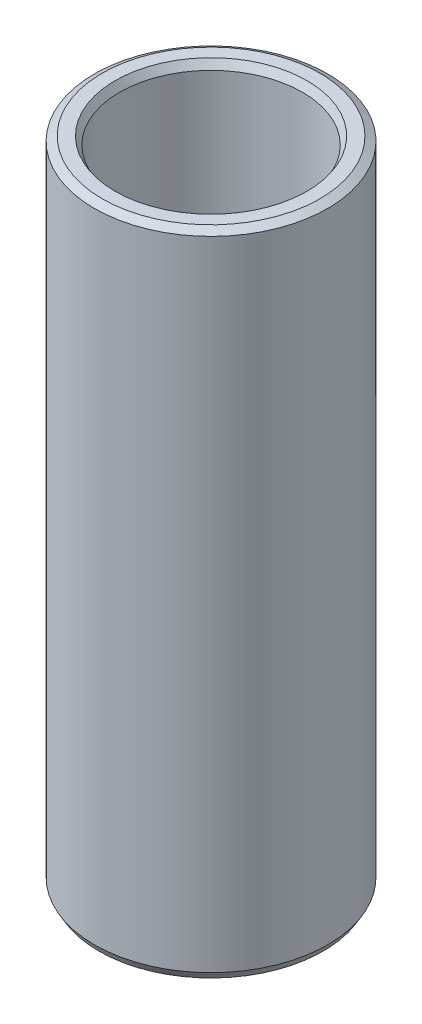
ISO-10303-21;
HEADER;
FILE_DESCRIPTION(('STEP AP214'),'2;1');
FILE_NAME('part.step','',(''),(''),'','','');
FILE_SCHEMA(('AUTOMOTIVE_DESIGN { 1 0 10303 214 1 1 1 1 }'));
ENDSEC;
DATA;
#1=APPLICATION_CONTEXT('core data for automotive mechanical design processes');
#2=APPLICATION_PROTOCOL_DEFINITION('international standard','automotive_design',2000,#1);
#3=PRODUCT_CONTEXT('',#1,'mechanical');
#4=PRODUCT('Part','Part','',(#3));
#5=PRODUCT_RELATED_PRODUCT_CATEGORY('part','',(#4));
#6=PRODUCT_DEFINITION_FORMATION('','',#4);
#7=PRODUCT_DEFINITION_CONTEXT('part definition',#1,'design');
#8=PRODUCT_DEFINITION('design','',#6,#7);
#9=PRODUCT_DEFINITION_SHAPE('','',#8);
#10=(LENGTH_UNIT() NAMED_UNIT(*) SI_UNIT(.MILLI.,.METRE.));
#11=(NAMED_UNIT(*) PLANE_ANGLE_UNIT() SI_UNIT($,.RADIAN.));
#12=(NAMED_UNIT(*) SI_UNIT($,.STERADIAN.) SOLID_ANGLE_UNIT());
#13=UNCERTAINTY_MEASURE_WITH_UNIT(LENGTH_MEASURE(1.E-05),#10,'distance_accuracy_value','');
#14=(GEOMETRIC_REPRESENTATION_CONTEXT(3) GLOBAL_UNCERTAINTY_ASSIGNED_CONTEXT((#13)) GLOBAL_UNIT_ASSIGNED_CONTEXT((#10,
#11,#12)) REPRESENTATION_CONTEXT('',''));
#15=CARTESIAN_POINT('',(0.,0.,0.));
#16=DIRECTION('',(0.,0.,1.));
#17=DIRECTION('',(1.,0.,0.));
#18=AXIS2_PLACEMENT_3D('',#15,#16,#17);
#19=CARTESIAN_POINT('',(0.,292.552172585517,0.));
#20=DIRECTION('',(0.,-1.,0.));
#21=DIRECTION('',(0.,0.,-1.));
#22=AXIS2_PLACEMENT_3D('',#19,#20,#21);
#23=CYLINDRICAL_SURFACE('',#22,52.5);
#24=CARTESIAN_POINT('',(0.,3.50682642514993,0.));
#25=DIRECTION('',(0.,1.,0.));
#26=DIRECTION('',(0.,0.,1.));
#27=AXIS2_PLACEMENT_3D('',#24,#25,#26);
#28=CIRCLE('',#27,52.5);
#29=CARTESIAN_POINT('',(0.,3.50682642514993,52.5));
#30=VERTEX_POINT('',#29);
#31=EDGE_CURVE('E10',#30,#30,#28,.T.);
#32=ORIENTED_EDGE('',*,*,#31,.T.);
#33=EDGE_LOOP('',(#32));
#34=FACE_BOUND('',#33,.T.);
#35=CARTESIAN_POINT('',(0.,290.527505404955,0.));
#36=DIRECTION('',(0.,1.,0.));
#37=DIRECTION('',(0.,0.,1.));
#38=AXIS2_PLACEMENT_3D('',#35,#36,#37);
#39=CIRCLE('',#38,52.5);
#40=CARTESIAN_POINT('',(0.,290.527505404955,52.5));
#41=VERTEX_POINT('',#40);
#42=EDGE_CURVE('E50',#41,#41,#39,.F.);
#43=ORIENTED_EDGE('',*,*,#42,.T.);
#44=EDGE_LOOP('',(#43));
#45=FACE_BOUND('',#44,.T.);
#46=ADVANCED_FACE('F39',(#34,#45),#23,.T.);
#47=CARTESIAN_POINT('',(0.,292.552172585517,0.));
#48=DIRECTION('',(0.,1.,0.));
#49=DIRECTION('',(0.,0.,1.));
#50=AXIS2_PLACEMENT_3D('',#47,#48,#49);
#51=PLANE('',#50);
#52=CARTESIAN_POINT('',(0.,292.552172585517,0.));
#53=DIRECTION('',(0.,1.,0.));
#54=DIRECTION('',(0.,0.,1.));
#55=AXIS2_PLACEMENT_3D('',#52,#53,#54);
#56=CIRCLE('',#55,43.1630909627018);
#57=CARTESIAN_POINT('',(0.,292.552172585517,43.1630909627018));
#58=VERTEX_POINT('',#57);
#59=EDGE_CURVE('E58',#58,#58,#56,.F.);
#60=ORIENTED_EDGE('',*,*,#59,.T.);
#61=EDGE_LOOP('',(#60));
#62=FACE_BOUND('',#61,.T.);
#63=CARTESIAN_POINT('',(0.,292.552172585517,0.));
#64=DIRECTION('',(0.,1.,0.));
#65=DIRECTION('',(0.,0.,1.));
#66=AXIS2_PLACEMENT_3D('',#63,#64,#65);
#67=CIRCLE('',#66,48.9931735748501);
#68=CARTESIAN_POINT('',(0.,292.552172585517,48.9931735748501));
#69=VERTEX_POINT('',#68);
#70=EDGE_CURVE('E61',#69,#69,#67,.T.);
#71=ORIENTED_EDGE('',*,*,#70,.T.);
#72=EDGE_LOOP('',(#71));
#73=FACE_BOUND('',#72,.T.);
#74=ADVANCED_FACE('F88',(#62,#73),#51,.T.);
#75=CARTESIAN_POINT('',(0.,0.,0.));
#76=DIRECTION('',(0.,1.,0.));
#77=DIRECTION('',(0.,0.,1.));
#78=AXIS2_PLACEMENT_3D('',#75,#76,#77);
#79=PLANE('',#78);
#80=CARTESIAN_POINT('',(0.,0.,0.));
#81=DIRECTION('',(0.,1.,0.));
#82=DIRECTION('',(0.,0.,1.));
#83=AXIS2_PLACEMENT_3D('',#80,#81,#82);
#84=CIRCLE('',#83,44.6452502072902);
#85=CARTESIAN_POINT('',(0.,0.,44.6452502072902));
#86=VERTEX_POINT('',#85);
#87=EDGE_CURVE('E51',#86,#86,#84,.T.);
#88=ORIENTED_EDGE('',*,*,#87,.T.);
#89=EDGE_LOOP('',(#88));
#90=FACE_BOUND('',#89,.T.);
#91=CARTESIAN_POINT('',(0.,0.,0.));
#92=DIRECTION('',(0.,1.,0.));
#93=DIRECTION('',(0.,0.,1.));
#94=AXIS2_PLACEMENT_3D('',#91,#92,#93);
#95=CIRCLE('',#94,50.4753328194384);
#96=CARTESIAN_POINT('',(0.,0.,50.4753328194384));
#97=VERTEX_POINT('',#96);
#98=EDGE_CURVE('E54',#97,#97,#95,.F.);
#99=ORIENTED_EDGE('',*,*,#98,.T.);
#100=EDGE_LOOP('',(#99));
#101=FACE_BOUND('',#100,.T.);
#102=ADVANCED_FACE('F83',(#90,#101),#79,.F.);
#103=CARTESIAN_POINT('',(0.,292.552172585517,0.));
#104=DIRECTION('',(0.,-1.,0.));
#105=DIRECTION('',(0.,0.,-1.));
#106=AXIS2_PLACEMENT_3D('',#103,#104,#105);
#107=CYLINDRICAL_SURFACE('',#106,41.1384237821402);
#108=CARTESIAN_POINT('',(0.,289.045346160367,0.));
#109=DIRECTION('',(0.,1.,0.));
#110=DIRECTION('',(0.,0.,1.));
#111=AXIS2_PLACEMENT_3D('',#108,#109,#110);
#112=CIRCLE('',#111,41.1384237821402);
#113=CARTESIAN_POINT('',(0.,289.045346160367,41.1384237821402));
#114=VERTEX_POINT('',#113);
#115=EDGE_CURVE('E67',#114,#114,#112,.T.);
#116=ORIENTED_EDGE('',*,*,#115,.T.);
#117=EDGE_LOOP('',(#116));
#118=FACE_BOUND('',#117,.T.);
#119=CARTESIAN_POINT('',(0.,2.02466718056171,0.));
#120=DIRECTION('',(0.,1.,0.));
#121=DIRECTION('',(0.,0.,1.));
#122=AXIS2_PLACEMENT_3D('',#119,#120,#121);
#123=CIRCLE('',#122,41.1384237821402);
#124=CARTESIAN_POINT('',(0.,2.02466718056171,41.1384237821402));
#125=VERTEX_POINT('',#124);
#126=EDGE_CURVE('E69',#125,#125,#123,.F.);
#127=ORIENTED_EDGE('',*,*,#126,.T.);
#128=EDGE_LOOP('',(#127));
#129=FACE_BOUND('',#128,.T.);
#130=ADVANCED_FACE('F71',(#118,#129),#107,.F.);
#131=CARTESIAN_POINT('',(0.,289.045346160367,0.));
#132=DIRECTION('',(0.,1.,0.));
#133=DIRECTION('',(0.,0.,1.));
#134=AXIS2_PLACEMENT_3D('',#131,#132,#133);
#135=CONICAL_SURFACE('',#134,41.1384237821402,0.523598775598303);
#136=CARTESIAN_POINT('',(0.,292.552172585517,43.1630909627018));
#137=CARTESIAN_POINT('',(0.,292.515643143588,43.142000679571));
#138=CARTESIAN_POINT('',(0.,292.479113701659,43.1209103964401));
#139=CARTESIAN_POINT('',(0.,292.406054817802,43.0787298301784));
#140=CARTESIAN_POINT('',(0.,292.369525375873,43.0576395470476));
#141=CARTESIAN_POINT('',(0.,292.296466492016,43.0154589807859));
#142=CARTESIAN_POINT('',(0.,292.259937050087,42.994368697655));
#143=CARTESIAN_POINT('',(0.,292.18687816623,42.9521881313933));
#144=CARTESIAN_POINT('',(0.,292.150348724301,42.9310978482625));
#145=CARTESIAN_POINT('',(0.,292.077289840444,42.8889172820007));
#146=CARTESIAN_POINT('',(0.,292.040760398515,42.8678269988699));
#147=CARTESIAN_POINT('',(0.,291.967701514658,42.8256464326082));
#148=CARTESIAN_POINT('',(0.,291.93117207273,42.8045561494773));
#149=CARTESIAN_POINT('',(0.,291.858113188872,42.7623755832156));
#150=CARTESIAN_POINT('',(0.,291.821583746944,42.7412853000848));
#151=CARTESIAN_POINT('',(0.,291.748524863086,42.6991047338231));
#152=CARTESIAN_POINT('',(0.,291.711995421158,42.6780144506922));
#153=CARTESIAN_POINT('',(0.,291.6389365373,42.6358338844305));
#154=CARTESIAN_POINT('',(0.,291.602407095372,42.6147436012997));
#155=CARTESIAN_POINT('',(0.,291.529348211514,42.572563035038));
#156=CARTESIAN_POINT('',(0.,291.492818769586,42.5514727519071));
#157=CARTESIAN_POINT('',(0.,291.419759885728,42.5092921856454));
#158=CARTESIAN_POINT('',(0.,291.3832304438,42.4882019025146));
#159=CARTESIAN_POINT('',(0.,291.310171559943,42.4460213362529));
#160=CARTESIAN_POINT('',(0.,291.273642118014,42.424931053122));
#161=CARTESIAN_POINT('',(0.,291.200583234157,42.3827504868603));
#162=CARTESIAN_POINT('',(0.,291.164053792228,42.3616602037295));
#163=CARTESIAN_POINT('',(0.,291.090994908371,42.3194796374678));
#164=CARTESIAN_POINT('',(0.,291.054465466442,42.2983893543369));
#165=CARTESIAN_POINT('',(0.,290.981406582585,42.2562087880752));
#166=CARTESIAN_POINT('',(0.,290.944877140656,42.2351185049444));
#167=CARTESIAN_POINT('',(0.,290.871818256799,42.1929379386827));
#168=CARTESIAN_POINT('',(0.,290.83528881487,42.1718476555518));
#169=CARTESIAN_POINT('',(0.,290.762229931013,42.1296670892901));
#170=CARTESIAN_POINT('',(0.,290.725700489084,42.1085768061593));
#171=CARTESIAN_POINT('',(0.,290.652641605227,42.0663962398976));
#172=CARTESIAN_POINT('',(0.,290.616112163298,42.0453059567667));
#173=CARTESIAN_POINT('',(0.,290.543053279441,42.003125390505));
#174=CARTESIAN_POINT('',(0.,290.506523837512,41.9820351073742));
#175=CARTESIAN_POINT('',(0.,290.433464953655,41.9398545411125));
#176=CARTESIAN_POINT('',(0.,290.396935511726,41.9187642579816));
#177=CARTESIAN_POINT('',(0.,290.323876627869,41.8765836917199));
#178=CARTESIAN_POINT('',(0.,290.28734718594,41.8554934085891));
#179=CARTESIAN_POINT('',(0.,290.214288302083,41.8133128423274));
#180=CARTESIAN_POINT('',(0.,290.177758860154,41.7922225591965));
#181=CARTESIAN_POINT('',(0.,290.104699976297,41.7500419929348));
#182=CARTESIAN_POINT('',(0.,290.068170534369,41.728951709804));
#183=CARTESIAN_POINT('',(0.,289.995111650511,41.6867711435423));
#184=CARTESIAN_POINT('',(0.,289.958582208583,41.6656808604114));
#185=CARTESIAN_POINT('',(0.,289.885523324725,41.6235002941497));
#186=CARTESIAN_POINT('',(0.,289.848993882797,41.6024100110189));
#187=CARTESIAN_POINT('',(0.,289.775934998939,41.5602294447572));
#188=CARTESIAN_POINT('',(0.,289.739405557011,41.5391391616263));
#189=CARTESIAN_POINT('',(0.,289.666346673153,41.4969585953646));
#190=CARTESIAN_POINT('',(0.,289.629817231225,41.4758683122338));
#191=CARTESIAN_POINT('',(0.,289.556758347368,41.4336877459721));
#192=CARTESIAN_POINT('',(0.,289.520228905439,41.4125974628412));
#193=CARTESIAN_POINT('',(0.,289.447170021582,41.3704168965795));
#194=CARTESIAN_POINT('',(0.,289.410640579653,41.3493266134487));
#195=CARTESIAN_POINT('',(0.,289.337581695796,41.307146047187));
#196=CARTESIAN_POINT('',(0.,289.301052253867,41.2860557640561));
#197=CARTESIAN_POINT('',(0.,289.22799337001,41.2438751977944));
#198=CARTESIAN_POINT('',(0.,289.191463928081,41.2227849146635));
#199=CARTESIAN_POINT('',(0.,289.118405044224,41.1806043484019));
#200=CARTESIAN_POINT('',(0.,289.081875602295,41.159514065271));
#201=CARTESIAN_POINT('',(0.,289.045346160367,41.1384237821402));
#202=B_SPLINE_CURVE_WITH_KNOTS('',3,(#136,#137,#138,#139,#140,#141,#142,#143,#144,#145,#146,
#147,#148,#149,#150,#151,#152,#153,#154,#155,#156,#157,#158,#159,#160,#161,#162,#163,#164,#165,
#166,#167,#168,#169,#170,#171,#172,#173,#174,#175,#176,#177,#178,#179,#180,#181,#182,#183,#184,
#185,#186,#187,#188,#189,#190,#191,#192,#193,#194,#195,#196,#197,#198,#199,#200,#201),
.UNSPECIFIED.,.F.,.F.,(4,2,2,2,2,2,2,2,2,2,2,2,2,2,2,2,2,2,2,2,2,2,2,2,2,2,2,2,2,2,2,2,4),(0.,
0.126541698785113,0.253083397570225,0.379625096355334,0.506166795140447,0.63270849392556,
0.759250192710624,0.885791891495737,1.01233359028085,1.13887528906596,1.26541698785107,
1.39195868663613,1.51850038542124,1.64504208420636,1.77158378299147,1.89812548177658,
2.02466718056164,2.15120887934676,2.27775057813187,2.40429227691698,2.53083397570209,
2.6573756744872,2.78391737327227,2.91045907205738,3.03700077084249,3.1635424696276,
3.29008416841272,3.41662586719778,3.54316756598289,3.669709264768,3.79625096355311,
3.92279266233823,4.04933436112329),.UNSPECIFIED.);
#203=EDGE_CURVE('BSEAM77',#58,#114,#202,.T.);
#204=ORIENTED_EDGE('',*,*,#59,.F.);
#205=ORIENTED_EDGE('',*,*,#115,.F.);
#206=ORIENTED_EDGE('',*,*,#203,.T.);
#207=ORIENTED_EDGE('',*,*,#203,.F.);
#208=EDGE_LOOP('',(#204,#206,#205,#207));
#209=FACE_BOUND('',#208,.T.);
#210=ADVANCED_FACE('F77',(#209),#135,.F.);
#211=CARTESIAN_POINT('',(0.,0.,0.));
#212=DIRECTION('',(0.,-1.,0.));
#213=DIRECTION('',(0.,0.,-1.));
#214=AXIS2_PLACEMENT_3D('',#211,#212,#213);
#215=CONICAL_SURFACE('',#214,44.6452502072902,1.04719755119659);
#216=ORIENTED_EDGE('',*,*,#126,.F.);
#217=EDGE_LOOP('',(#216));
#218=FACE_BOUND('',#217,.T.);
#219=ORIENTED_EDGE('',*,*,#87,.F.);
#220=EDGE_LOOP('',(#219));
#221=FACE_BOUND('',#220,.T.);
#222=ADVANCED_FACE('F73',(#218,#221),#215,.F.);
#223=CARTESIAN_POINT('',(0.,3.50682642514993,0.));
#224=DIRECTION('',(0.,1.,0.));
#225=DIRECTION('',(0.,0.,1.));
#226=AXIS2_PLACEMENT_3D('',#223,#224,#225);
#227=CONICAL_SURFACE('',#226,52.5,0.523598775598302);
#228=ORIENTED_EDGE('',*,*,#98,.F.);
#229=EDGE_LOOP('',(#228));
#230=FACE_BOUND('',#229,.T.);
#231=ORIENTED_EDGE('',*,*,#31,.F.);
#232=EDGE_LOOP('',(#231));
#233=FACE_BOUND('',#232,.T.);
#234=ADVANCED_FACE('F76',(#230,#233),#227,.T.);
#235=CARTESIAN_POINT('',(0.,292.552172585517,0.));
#236=DIRECTION('',(0.,-1.,0.));
#237=DIRECTION('',(0.,0.,-1.));
#238=AXIS2_PLACEMENT_3D('',#235,#236,#237);
#239=CONICAL_SURFACE('',#238,48.9931735748501,1.04719755119659);
#240=ORIENTED_EDGE('',*,*,#42,.F.);
#241=EDGE_LOOP('',(#240));
#242=FACE_BOUND('',#241,.T.);
#243=ORIENTED_EDGE('',*,*,#70,.F.);
#244=EDGE_LOOP('',(#243));
#245=FACE_BOUND('',#244,.T.);
#246=ADVANCED_FACE('F45',(#242,#245),#239,.T.);
#247=CLOSED_SHELL('',(#46,#74,#102,#130,#210,#222,#234,#246));
#248=MANIFOLD_SOLID_BREP('B2',#247);
#249=ADVANCED_BREP_SHAPE_REPRESENTATION('',(#18,#248),#14);
#250=SHAPE_DEFINITION_REPRESENTATION(#9,#249);
ENDSEC;
END-ISO-10303-21;
